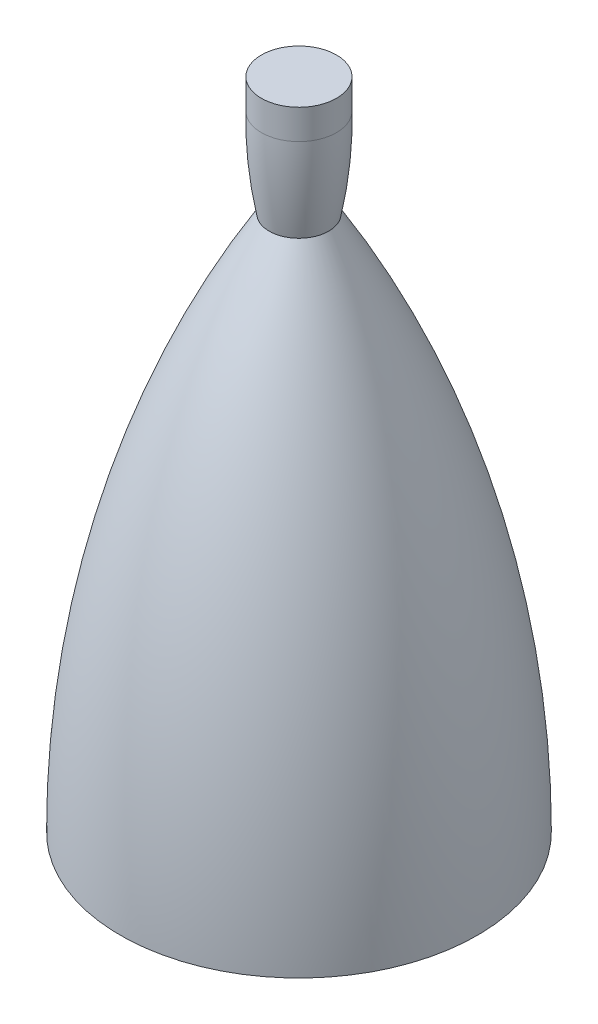
ISO-10303-21;
HEADER;
FILE_DESCRIPTION(('STEP AP214'),'2;1');
FILE_NAME('part.step','',(''),(''),'','','');
FILE_SCHEMA(('AUTOMOTIVE_DESIGN { 1 0 10303 214 1 1 1 1 }'));
ENDSEC;
DATA;
#1=APPLICATION_CONTEXT('core data for automotive mechanical design processes');
#2=APPLICATION_PROTOCOL_DEFINITION('international standard','automotive_design',2000,#1);
#3=PRODUCT_CONTEXT('',#1,'mechanical');
#4=PRODUCT('Part','Part','',(#3));
#5=PRODUCT_RELATED_PRODUCT_CATEGORY('part','',(#4));
#6=PRODUCT_DEFINITION_FORMATION('','',#4);
#7=PRODUCT_DEFINITION_CONTEXT('part definition',#1,'design');
#8=PRODUCT_DEFINITION('design','',#6,#7);
#9=PRODUCT_DEFINITION_SHAPE('','',#8);
#10=(LENGTH_UNIT() NAMED_UNIT(*) SI_UNIT(.MILLI.,.METRE.));
#11=(NAMED_UNIT(*) PLANE_ANGLE_UNIT() SI_UNIT($,.RADIAN.));
#12=(NAMED_UNIT(*) SI_UNIT($,.STERADIAN.) SOLID_ANGLE_UNIT());
#13=UNCERTAINTY_MEASURE_WITH_UNIT(LENGTH_MEASURE(1.E-05),#10,'distance_accuracy_value','');
#14=(GEOMETRIC_REPRESENTATION_CONTEXT(3) GLOBAL_UNCERTAINTY_ASSIGNED_CONTEXT((#13)) GLOBAL_UNIT_ASSIGNED_CONTEXT((#10,
#11,#12)) REPRESENTATION_CONTEXT('',''));
#15=CARTESIAN_POINT('',(0.,0.,0.));
#16=DIRECTION('',(0.,0.,1.));
#17=DIRECTION('',(1.,0.,0.));
#18=AXIS2_PLACEMENT_3D('',#15,#16,#17);
#19=CARTESIAN_POINT('',(0.,0.,0.));
#20=DIRECTION('',(0.,-1.,0.));
#21=DIRECTION('',(0.,0.,-1.));
#22=AXIS2_PLACEMENT_3D('',#19,#20,#21);
#23=PLANE('',#22);
#24=CARTESIAN_POINT('',(0.,0.,0.));
#25=DIRECTION('',(0.,-1.,0.));
#26=DIRECTION('',(0.,0.,-1.));
#27=AXIS2_PLACEMENT_3D('',#24,#25,#26);
#28=CIRCLE('',#27,152.4);
#29=CARTESIAN_POINT('',(0.,0.,-152.4));
#30=VERTEX_POINT('',#29);
#31=EDGE_CURVE('E10',#30,#30,#28,.T.);
#32=ORIENTED_EDGE('',*,*,#31,.T.);
#33=EDGE_LOOP('',(#32));
#34=FACE_BOUND('',#33,.T.);
#35=ADVANCED_FACE('F35',(#34),#23,.T.);
#36=CARTESIAN_POINT('',(0.,0.575026689444563,0.));
#37=DIRECTION('',(0.,-1.,0.));
#38=DIRECTION('',(0.,0.,-1.));
#39=AXIS2_PLACEMENT_3D('',#36,#37,#38);
#40=DEGENERATE_TOROIDAL_SURFACE('',#39,731.989903918,884.390090857978,.F.);
#41=CARTESIAN_POINT('',(0.,457.2,0.));
#42=DIRECTION('',(0.,-1.,0.));
#43=DIRECTION('',(0.,0.,-1.));
#44=AXIS2_PLACEMENT_3D('',#41,#42,#43);
#45=CIRCLE('',#44,25.4);
#46=CARTESIAN_POINT('',(0.,457.2,-25.4));
#47=VERTEX_POINT('',#46);
#48=EDGE_CURVE('E41',#47,#47,#45,.T.);
#49=ORIENTED_EDGE('',*,*,#48,.T.);
#50=EDGE_LOOP('',(#49));
#51=FACE_BOUND('',#50,.T.);
#52=ORIENTED_EDGE('',*,*,#31,.F.);
#53=EDGE_LOOP('',(#52));
#54=FACE_BOUND('',#53,.T.);
#55=ADVANCED_FACE('F67',(#51,#54),#40,.F.);
#56=CARTESIAN_POINT('',(0.,527.273403709567,0.));
#57=DIRECTION('',(0.,-1.,0.));
#58=DIRECTION('',(0.,0.,-1.));
#59=AXIS2_PLACEMENT_3D('',#56,#57,#58);
#60=DEGENERATE_TOROIDAL_SURFACE('',#59,337.111424080174,369.221904139069,.F.);
#61=CARTESIAN_POINT('',(0.,533.4,0.));
#62=DIRECTION('',(0.,-1.,0.));
#63=DIRECTION('',(0.,0.,-1.));
#64=AXIS2_PLACEMENT_3D('',#61,#62,#63);
#65=CIRCLE('',#64,32.0596464467212);
#66=CARTESIAN_POINT('',(0.,533.4,-32.0596464467212));
#67=VERTEX_POINT('',#66);
#68=EDGE_CURVE('E45',#67,#67,#65,.T.);
#69=ORIENTED_EDGE('',*,*,#68,.T.);
#70=EDGE_LOOP('',(#69));
#71=FACE_BOUND('',#70,.T.);
#72=ORIENTED_EDGE('',*,*,#48,.F.);
#73=EDGE_LOOP('',(#72));
#74=FACE_BOUND('',#73,.T.);
#75=ADVANCED_FACE('F64',(#71,#74),#60,.F.);
#76=CARTESIAN_POINT('',(0.,0.,0.));
#77=DIRECTION('',(0.,-1.,0.));
#78=DIRECTION('',(0.,0.,-1.));
#79=AXIS2_PLACEMENT_3D('',#76,#77,#78);
#80=CYLINDRICAL_SURFACE('',#79,32.0596464467212);
#81=CARTESIAN_POINT('',(0.,558.8,0.));
#82=DIRECTION('',(0.,-1.,0.));
#83=DIRECTION('',(0.,0.,-1.));
#84=AXIS2_PLACEMENT_3D('',#81,#82,#83);
#85=CIRCLE('',#84,32.0596464467212);
#86=CARTESIAN_POINT('',(0.,558.8,-32.0596464467212));
#87=VERTEX_POINT('',#86);
#88=EDGE_CURVE('E49',#87,#87,#85,.T.);
#89=ORIENTED_EDGE('',*,*,#88,.T.);
#90=EDGE_LOOP('',(#89));
#91=FACE_BOUND('',#90,.T.);
#92=ORIENTED_EDGE('',*,*,#68,.F.);
#93=EDGE_LOOP('',(#92));
#94=FACE_BOUND('',#93,.T.);
#95=ADVANCED_FACE('F55',(#91,#94),#80,.T.);
#96=CARTESIAN_POINT('',(0.,558.8,0.));
#97=DIRECTION('',(0.,1.,0.));
#98=DIRECTION('',(0.,0.,1.));
#99=AXIS2_PLACEMENT_3D('',#96,#97,#98);
#100=PLANE('',#99);
#101=ORIENTED_EDGE('',*,*,#88,.F.);
#102=EDGE_LOOP('',(#101));
#103=FACE_BOUND('',#102,.T.);
#104=ADVANCED_FACE('F58',(#103),#100,.T.);
#105=CLOSED_SHELL('',(#35,#55,#75,#95,#104));
#106=MANIFOLD_SOLID_BREP('B2',#105);
#107=ADVANCED_BREP_SHAPE_REPRESENTATION('',(#18,#106),#14);
#108=SHAPE_DEFINITION_REPRESENTATION(#9,#107);
ENDSEC;
END-ISO-10303-21;
